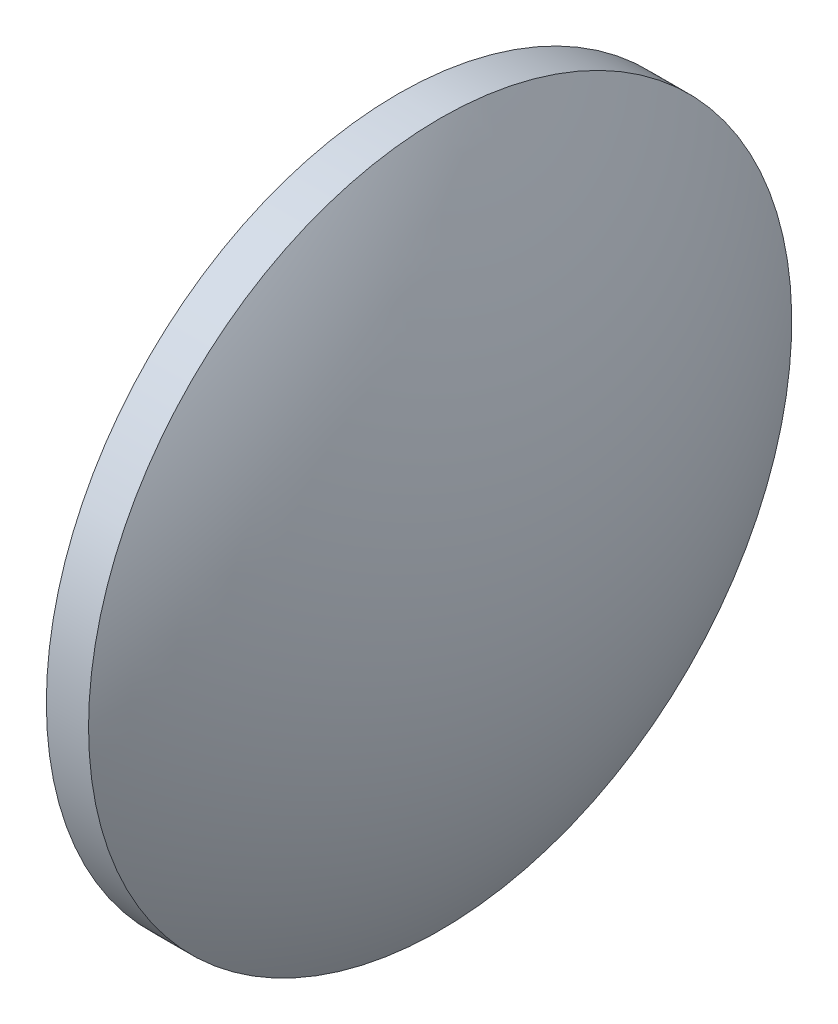
ISO-10303-21;
HEADER;
FILE_DESCRIPTION(('STEP AP214'),'2;1');
FILE_NAME('part.step','',(''),(''),'','','');
FILE_SCHEMA(('AUTOMOTIVE_DESIGN { 1 0 10303 214 1 1 1 1 }'));
ENDSEC;
DATA;
#1=APPLICATION_CONTEXT('core data for automotive mechanical design processes');
#2=APPLICATION_PROTOCOL_DEFINITION('international standard','automotive_design',2000,#1);
#3=PRODUCT_CONTEXT('',#1,'mechanical');
#4=PRODUCT('Part','Part','',(#3));
#5=PRODUCT_RELATED_PRODUCT_CATEGORY('part','',(#4));
#6=PRODUCT_DEFINITION_FORMATION('','',#4);
#7=PRODUCT_DEFINITION_CONTEXT('part definition',#1,'design');
#8=PRODUCT_DEFINITION('design','',#6,#7);
#9=PRODUCT_DEFINITION_SHAPE('','',#8);
#10=(LENGTH_UNIT() NAMED_UNIT(*) SI_UNIT(.MILLI.,.METRE.));
#11=(NAMED_UNIT(*) PLANE_ANGLE_UNIT() SI_UNIT($,.RADIAN.));
#12=(NAMED_UNIT(*) SI_UNIT($,.STERADIAN.) SOLID_ANGLE_UNIT());
#13=UNCERTAINTY_MEASURE_WITH_UNIT(LENGTH_MEASURE(1.E-05),#10,'distance_accuracy_value','');
#14=(GEOMETRIC_REPRESENTATION_CONTEXT(3) GLOBAL_UNCERTAINTY_ASSIGNED_CONTEXT((#13)) GLOBAL_UNIT_ASSIGNED_CONTEXT((#10,
#11,#12)) REPRESENTATION_CONTEXT('',''));
#15=CARTESIAN_POINT('',(0.,0.,0.));
#16=DIRECTION('',(0.,0.,1.));
#17=DIRECTION('',(1.,0.,0.));
#18=AXIS2_PLACEMENT_3D('',#15,#16,#17);
#19=CARTESIAN_POINT('',(210.357148622629,95.7010098881601,0.));
#20=DIRECTION('',(-1.,0.,0.));
#21=DIRECTION('',(0.,1.,0.));
#22=AXIS2_PLACEMENT_3D('',#19,#20,#21);
#23=SPHERICAL_SURFACE('',#22,48.5888537906143);
#24=CARTESIAN_POINT('',(168.693294832015,95.7010098881601,0.));
#25=DIRECTION('',(-1.,0.,0.));
#26=DIRECTION('',(0.,0.,1.));
#27=AXIS2_PLACEMENT_3D('',#24,#25,#26);
#28=CIRCLE('',#27,25.0000000000003);
#29=CARTESIAN_POINT('',(168.693294832015,95.7010098881601,25.0000000000003));
#30=VERTEX_POINT('',#29);
#31=EDGE_CURVE('E41',#30,#30,#28,.T.);
#32=ORIENTED_EDGE('',*,*,#31,.T.);
#33=EDGE_LOOP('',(#32));
#34=FACE_BOUND('',#33,.T.);
#35=ADVANCED_FACE('F35',(#34),#23,.T.);
#36=CARTESIAN_POINT('',(130.029441041401,95.7010098881601,0.));
#37=DIRECTION('',(-1.,0.,0.));
#38=DIRECTION('',(0.,1.,0.));
#39=AXIS2_PLACEMENT_3D('',#36,#37,#38);
#40=SPHERICAL_SURFACE('',#39,48.5888537906143);
#41=CARTESIAN_POINT('',(171.693294832015,95.7010098881601,0.));
#42=DIRECTION('',(-1.,0.,0.));
#43=DIRECTION('',(0.,0.,1.));
#44=AXIS2_PLACEMENT_3D('',#41,#42,#43);
#45=CIRCLE('',#44,25.0000000000003);
#46=CARTESIAN_POINT('',(171.693294832015,95.7010098881601,25.0000000000003));
#47=VERTEX_POINT('',#46);
#48=EDGE_CURVE('E10',#47,#47,#45,.T.);
#49=ORIENTED_EDGE('',*,*,#48,.F.);
#50=EDGE_LOOP('',(#49));
#51=FACE_BOUND('',#50,.T.);
#52=ADVANCED_FACE('F50',(#51),#40,.T.);
#53=CARTESIAN_POINT('',(157.940955212316,95.7010098881601,0.));
#54=DIRECTION('',(-1.,0.,0.));
#55=DIRECTION('',(0.,0.,1.));
#56=AXIS2_PLACEMENT_3D('',#53,#54,#55);
#57=CYLINDRICAL_SURFACE('',#56,25.0000000000003);
#58=ORIENTED_EDGE('',*,*,#48,.T.);
#59=EDGE_LOOP('',(#58));
#60=FACE_BOUND('',#59,.T.);
#61=ORIENTED_EDGE('',*,*,#31,.F.);
#62=EDGE_LOOP('',(#61));
#63=FACE_BOUND('',#62,.T.);
#64=ADVANCED_FACE('F48',(#60,#63),#57,.T.);
#65=CLOSED_SHELL('',(#35,#52,#64));
#66=MANIFOLD_SOLID_BREP('B2',#65);
#67=ADVANCED_BREP_SHAPE_REPRESENTATION('',(#18,#66),#14);
#68=SHAPE_DEFINITION_REPRESENTATION(#9,#67);
ENDSEC;
END-ISO-10303-21;
